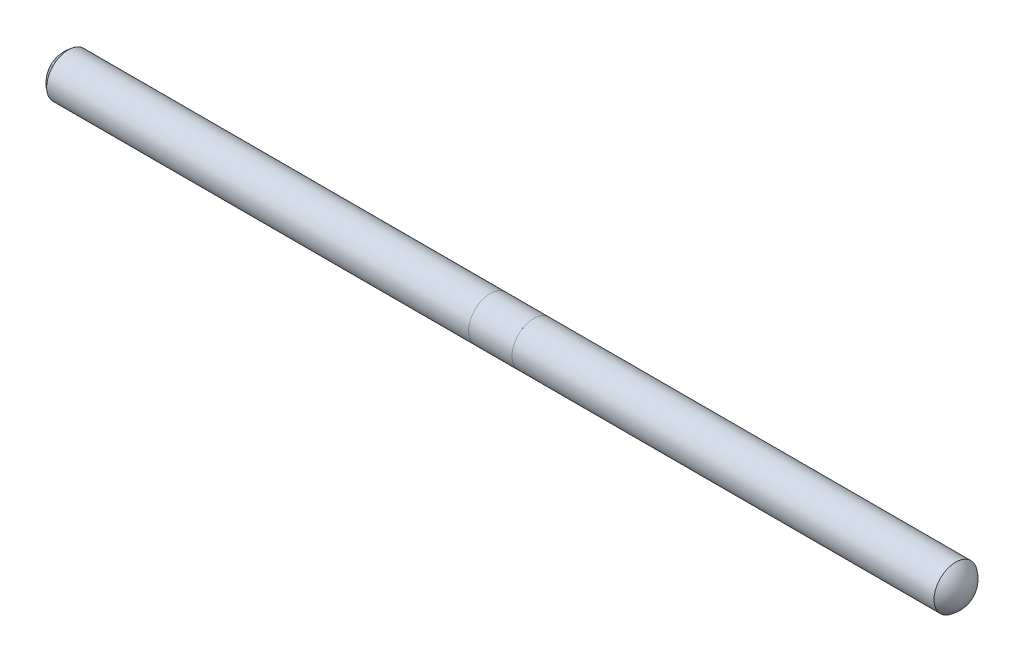
ISO-10303-21;
HEADER;
FILE_DESCRIPTION(('STEP AP214'),'2;1');
FILE_NAME('part.step','',(''),(''),'','','');
FILE_SCHEMA(('AUTOMOTIVE_DESIGN { 1 0 10303 214 1 1 1 1 }'));
ENDSEC;
DATA;
#1=APPLICATION_CONTEXT('core data for automotive mechanical design processes');
#2=APPLICATION_PROTOCOL_DEFINITION('international standard','automotive_design',2000,#1);
#3=PRODUCT_CONTEXT('',#1,'mechanical');
#4=PRODUCT('Part','Part','',(#3));
#5=PRODUCT_RELATED_PRODUCT_CATEGORY('part','',(#4));
#6=PRODUCT_DEFINITION_FORMATION('','',#4);
#7=PRODUCT_DEFINITION_CONTEXT('part definition',#1,'design');
#8=PRODUCT_DEFINITION('design','',#6,#7);
#9=PRODUCT_DEFINITION_SHAPE('','',#8);
#10=(LENGTH_UNIT() NAMED_UNIT(*) SI_UNIT(.MILLI.,.METRE.));
#11=(NAMED_UNIT(*) PLANE_ANGLE_UNIT() SI_UNIT($,.RADIAN.));
#12=(NAMED_UNIT(*) SI_UNIT($,.STERADIAN.) SOLID_ANGLE_UNIT());
#13=UNCERTAINTY_MEASURE_WITH_UNIT(LENGTH_MEASURE(1.E-05),#10,'distance_accuracy_value','');
#14=(GEOMETRIC_REPRESENTATION_CONTEXT(3) GLOBAL_UNCERTAINTY_ASSIGNED_CONTEXT((#13)) GLOBAL_UNIT_ASSIGNED_CONTEXT((#10,
#11,#12)) REPRESENTATION_CONTEXT('',''));
#15=CARTESIAN_POINT('',(0.,0.,0.));
#16=DIRECTION('',(0.,0.,1.));
#17=DIRECTION('',(1.,0.,0.));
#18=AXIS2_PLACEMENT_3D('',#15,#16,#17);
#19=CARTESIAN_POINT('',(204.,0.,0.));
#20=DIRECTION('',(-1.,0.,0.));
#21=DIRECTION('',(0.,1.,0.));
#22=AXIS2_PLACEMENT_3D('',#19,#20,#21);
#23=SPHERICAL_SURFACE('',#22,5.99999999999998);
#24=CARTESIAN_POINT('',(207.316624790355,0.,0.));
#25=DIRECTION('',(-1.,0.,0.));
#26=DIRECTION('',(0.,0.,1.));
#27=AXIS2_PLACEMENT_3D('',#24,#25,#26);
#28=CIRCLE('',#27,5.);
#29=CARTESIAN_POINT('',(207.316624790355,0.,5.));
#30=VERTEX_POINT('',#29);
#31=EDGE_CURVE('E11',#30,#30,#28,.T.);
#32=ORIENTED_EDGE('',*,*,#31,.T.);
#33=EDGE_LOOP('',(#32));
#34=FACE_BOUND('',#33,.T.);
#35=ADVANCED_FACE('F47',(#34),#23,.F.);
#36=OPEN_SHELL('',(#35));
#37=SHELL_BASED_SURFACE_MODEL('B2',(#36));
#38=CARTESIAN_POINT('',(6.,0.,0.));
#39=DIRECTION('',(-1.,0.,0.));
#40=DIRECTION('',(0.,-1.,0.));
#41=AXIS2_PLACEMENT_3D('',#38,#39,#40);
#42=SPHERICAL_SURFACE('',#41,6.);
#43=CARTESIAN_POINT('',(2.68337520964459,0.,0.));
#44=DIRECTION('',(-1.,0.,0.));
#45=DIRECTION('',(0.,0.,1.));
#46=AXIS2_PLACEMENT_3D('',#43,#44,#45);
#47=CIRCLE('',#46,5.);
#48=CARTESIAN_POINT('',(2.68337520964459,0.,5.));
#49=VERTEX_POINT('',#48);
#50=EDGE_CURVE('E46',#49,#49,#47,.T.);
#51=ORIENTED_EDGE('',*,*,#50,.T.);
#52=EDGE_LOOP('',(#51));
#53=FACE_BOUND('',#52,.T.);
#54=ADVANCED_FACE('F73',(#53),#42,.T.);
#55=OPEN_SHELL('',(#54));
#56=SHELL_BASED_SURFACE_MODEL('B6',(#55));
#57=CARTESIAN_POINT('',(100.,0.,0.));
#58=DIRECTION('',(1.,0.,0.));
#59=DIRECTION('',(0.,0.,-1.));
#60=AXIS2_PLACEMENT_3D('',#57,#58,#59);
#61=PLANE('',#60);
#62=CARTESIAN_POINT('',(100.,0.,0.));
#63=DIRECTION('',(1.,0.,0.));
#64=DIRECTION('',(0.,0.,-1.));
#65=AXIS2_PLACEMENT_3D('',#62,#63,#64);
#66=CIRCLE('',#65,5.);
#67=CARTESIAN_POINT('',(100.,0.,-5.));
#68=VERTEX_POINT('',#67);
#69=EDGE_CURVE('E103',#68,#68,#66,.T.);
#70=ORIENTED_EDGE('',*,*,#69,.T.);
#71=EDGE_LOOP('',(#70));
#72=FACE_BOUND('',#71,.T.);
#73=ADVANCED_FACE('F99',(#72),#61,.T.);
#74=CARTESIAN_POINT('',(6.,0.,0.));
#75=DIRECTION('',(-1.,0.,0.));
#76=DIRECTION('',(0.,-1.,0.));
#77=AXIS2_PLACEMENT_3D('',#74,#75,#76);
#78=SPHERICAL_SURFACE('',#77,6.);
#79=CARTESIAN_POINT('',(2.68337520964461,0.,0.));
#80=DIRECTION('',(1.,0.,0.));
#81=DIRECTION('',(0.,0.,-1.));
#82=AXIS2_PLACEMENT_3D('',#79,#80,#81);
#83=CIRCLE('',#82,5.);
#84=CARTESIAN_POINT('',(2.68337520964461,0.,-5.));
#85=VERTEX_POINT('',#84);
#86=EDGE_CURVE('E71',#85,#85,#83,.F.);
#87=ORIENTED_EDGE('',*,*,#86,.T.);
#88=EDGE_LOOP('',(#87));
#89=FACE_BOUND('',#88,.T.);
#90=CARTESIAN_POINT('',(0.,0.,0.));
#91=VERTEX_POINT('',#90);
#92=VERTEX_LOOP('',#91);
#93=FACE_BOUND('',#92,.T.);
#94=ADVANCED_FACE('F110',(#89,#93),#78,.T.);
#95=CARTESIAN_POINT('',(210.,0.,0.));
#96=DIRECTION('',(-1.,0.,0.));
#97=DIRECTION('',(0.,0.,1.));
#98=AXIS2_PLACEMENT_3D('',#95,#96,#97);
#99=CYLINDRICAL_SURFACE('',#98,5.);
#100=ORIENTED_EDGE('',*,*,#86,.F.);
#101=EDGE_LOOP('',(#100));
#102=FACE_BOUND('',#101,.T.);
#103=ORIENTED_EDGE('',*,*,#69,.F.);
#104=EDGE_LOOP('',(#103));
#105=FACE_BOUND('',#104,.T.);
#106=ADVANCED_FACE('F101',(#102,#105),#99,.T.);
#107=CLOSED_SHELL('',(#73,#94,#106));
#108=MANIFOLD_SOLID_BREP('B41',#107);
#109=CARTESIAN_POINT('',(110.,0.,0.));
#110=DIRECTION('',(1.,0.,0.));
#111=DIRECTION('',(0.,0.,-1.));
#112=AXIS2_PLACEMENT_3D('',#109,#110,#111);
#113=PLANE('',#112);
#114=CARTESIAN_POINT('',(110.,0.,0.));
#115=DIRECTION('',(1.,0.,0.));
#116=DIRECTION('',(0.,0.,-1.));
#117=AXIS2_PLACEMENT_3D('',#114,#115,#116);
#118=CIRCLE('',#117,5.);
#119=CARTESIAN_POINT('',(110.,0.,-5.));
#120=VERTEX_POINT('',#119);
#121=EDGE_CURVE('E155',#120,#120,#118,.T.);
#122=ORIENTED_EDGE('',*,*,#121,.F.);
#123=EDGE_LOOP('',(#122));
#124=FACE_BOUND('',#123,.T.);
#125=ADVANCED_FACE('F151',(#124),#113,.F.);
#126=CARTESIAN_POINT('',(204.,0.,0.));
#127=DIRECTION('',(-1.,0.,0.));
#128=DIRECTION('',(0.,1.,0.));
#129=AXIS2_PLACEMENT_3D('',#126,#127,#128);
#130=SPHERICAL_SURFACE('',#129,5.99999999999998);
#131=CARTESIAN_POINT('',(210.,0.,0.));
#132=VERTEX_POINT('',#131);
#133=VERTEX_LOOP('',#132);
#134=FACE_BOUND('',#133,.T.);
#135=CARTESIAN_POINT('',(207.316624790355,0.,0.));
#136=DIRECTION('',(-1.,0.,0.));
#137=DIRECTION('',(0.,0.,1.));
#138=AXIS2_PLACEMENT_3D('',#135,#136,#137);
#139=CIRCLE('',#138,5.);
#140=CARTESIAN_POINT('',(207.316624790355,0.,5.));
#141=VERTEX_POINT('',#140);
#142=EDGE_CURVE('E97',#141,#141,#139,.T.);
#143=ORIENTED_EDGE('',*,*,#142,.F.);
#144=EDGE_LOOP('',(#143));
#145=FACE_BOUND('',#144,.T.);
#146=ADVANCED_FACE('F162',(#134,#145),#130,.T.);
#147=CARTESIAN_POINT('',(210.,0.,0.));
#148=DIRECTION('',(-1.,0.,0.));
#149=DIRECTION('',(0.,0.,1.));
#150=AXIS2_PLACEMENT_3D('',#147,#148,#149);
#151=CYLINDRICAL_SURFACE('',#150,5.);
#152=ORIENTED_EDGE('',*,*,#121,.T.);
#153=EDGE_LOOP('',(#152));
#154=FACE_BOUND('',#153,.T.);
#155=ORIENTED_EDGE('',*,*,#142,.T.);
#156=EDGE_LOOP('',(#155));
#157=FACE_BOUND('',#156,.T.);
#158=ADVANCED_FACE('F153',(#154,#157),#151,.T.);
#159=CLOSED_SHELL('',(#125,#146,#158));
#160=MANIFOLD_SOLID_BREP('B65',#159);
#161=CARTESIAN_POINT('',(100.,0.,0.));
#162=DIRECTION('',(1.,0.,0.));
#163=DIRECTION('',(0.,0.,-1.));
#164=AXIS2_PLACEMENT_3D('',#161,#162,#163);
#165=PLANE('',#164);
#166=CARTESIAN_POINT('',(100.,0.,0.));
#167=DIRECTION('',(1.,0.,0.));
#168=DIRECTION('',(0.,0.,-1.));
#169=AXIS2_PLACEMENT_3D('',#166,#167,#168);
#170=CIRCLE('',#169,5.);
#171=CARTESIAN_POINT('',(100.,0.,-5.));
#172=VERTEX_POINT('',#171);
#173=EDGE_CURVE('E203',#172,#172,#170,.T.);
#174=ORIENTED_EDGE('',*,*,#173,.F.);
#175=EDGE_LOOP('',(#174));
#176=FACE_BOUND('',#175,.T.);
#177=ADVANCED_FACE('F197',(#176),#165,.F.);
#178=CARTESIAN_POINT('',(110.,0.,0.));
#179=DIRECTION('',(1.,0.,0.));
#180=DIRECTION('',(0.,0.,-1.));
#181=AXIS2_PLACEMENT_3D('',#178,#179,#180);
#182=PLANE('',#181);
#183=CARTESIAN_POINT('',(110.,0.,0.));
#184=DIRECTION('',(1.,0.,0.));
#185=DIRECTION('',(0.,0.,-1.));
#186=AXIS2_PLACEMENT_3D('',#183,#184,#185);
#187=CIRCLE('',#186,5.);
#188=CARTESIAN_POINT('',(110.,0.,-5.));
#189=VERTEX_POINT('',#188);
#190=EDGE_CURVE('E150',#189,#189,#187,.T.);
#191=ORIENTED_EDGE('',*,*,#190,.T.);
#192=EDGE_LOOP('',(#191));
#193=FACE_BOUND('',#192,.T.);
#194=ADVANCED_FACE('F213',(#193),#182,.T.);
#195=CARTESIAN_POINT('',(210.,0.,0.));
#196=DIRECTION('',(-1.,0.,0.));
#197=DIRECTION('',(0.,0.,1.));
#198=AXIS2_PLACEMENT_3D('',#195,#196,#197);
#199=CYLINDRICAL_SURFACE('',#198,5.);
#200=ORIENTED_EDGE('',*,*,#173,.T.);
#201=EDGE_LOOP('',(#200));
#202=FACE_BOUND('',#201,.T.);
#203=ORIENTED_EDGE('',*,*,#190,.F.);
#204=EDGE_LOOP('',(#203));
#205=FACE_BOUND('',#204,.T.);
#206=ADVANCED_FACE('F209',(#202,#205),#199,.T.);
#207=CLOSED_SHELL('',(#177,#194,#206));
#208=MANIFOLD_SOLID_BREP('B91',#207);
#209=ADVANCED_BREP_SHAPE_REPRESENTATION('',(#18,#108,#160,#208),#14);
#210=MANIFOLD_SURFACE_SHAPE_REPRESENTATION('',(#18,#37,#56),#14);
#211=SHAPE_REPRESENTATION('',(#18),#14);
#212=SHAPE_DEFINITION_REPRESENTATION(#9,#211);
#213=SHAPE_REPRESENTATION_RELATIONSHIP('','',#211,#209);
#214=SHAPE_REPRESENTATION_RELATIONSHIP('','',#211,#210);
ENDSEC;
END-ISO-10303-21;
